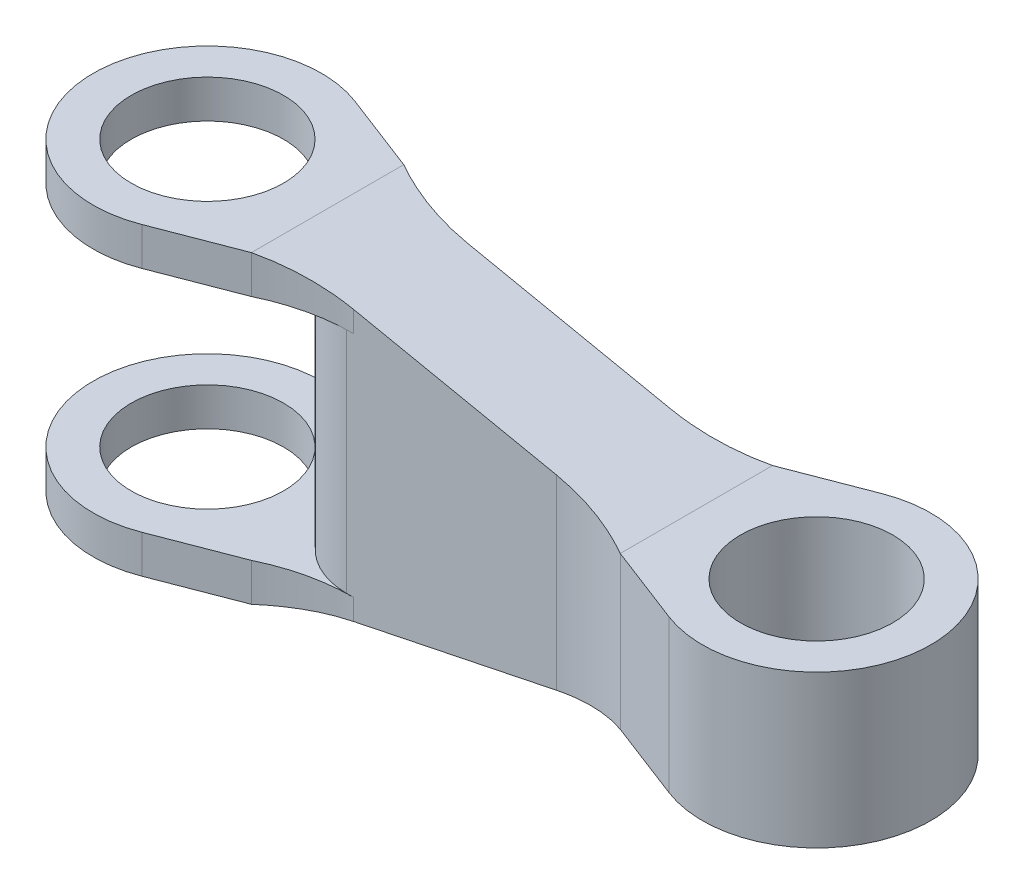
ISO-10303-21;
HEADER;
FILE_DESCRIPTION(('STEP AP214'),'2;1');
FILE_NAME('part.step','',(''),(''),'','','');
FILE_SCHEMA(('AUTOMOTIVE_DESIGN { 1 0 10303 214 1 1 1 1 }'));
ENDSEC;
DATA;
#1=APPLICATION_CONTEXT('core data for automotive mechanical design processes');
#2=APPLICATION_PROTOCOL_DEFINITION('international standard','automotive_design',2000,#1);
#3=PRODUCT_CONTEXT('',#1,'mechanical');
#4=PRODUCT('Part','Part','',(#3));
#5=PRODUCT_RELATED_PRODUCT_CATEGORY('part','',(#4));
#6=PRODUCT_DEFINITION_FORMATION('','',#4);
#7=PRODUCT_DEFINITION_CONTEXT('part definition',#1,'design');
#8=PRODUCT_DEFINITION('design','',#6,#7);
#9=PRODUCT_DEFINITION_SHAPE('','',#8);
#10=(LENGTH_UNIT() NAMED_UNIT(*) SI_UNIT(.MILLI.,.METRE.));
#11=(NAMED_UNIT(*) PLANE_ANGLE_UNIT() SI_UNIT($,.RADIAN.));
#12=(NAMED_UNIT(*) SI_UNIT($,.STERADIAN.) SOLID_ANGLE_UNIT());
#13=UNCERTAINTY_MEASURE_WITH_UNIT(LENGTH_MEASURE(1.E-05),#10,'distance_accuracy_value','');
#14=(GEOMETRIC_REPRESENTATION_CONTEXT(3) GLOBAL_UNCERTAINTY_ASSIGNED_CONTEXT((#13)) GLOBAL_UNIT_ASSIGNED_CONTEXT((#10,
#11,#12)) REPRESENTATION_CONTEXT('',''));
#15=CARTESIAN_POINT('',(0.,0.,0.));
#16=DIRECTION('',(0.,0.,1.));
#17=DIRECTION('',(1.,0.,0.));
#18=AXIS2_PLACEMENT_3D('',#15,#16,#17);
#19=CARTESIAN_POINT('',(0.,10.16,0.));
#20=DIRECTION('',(0.,-1.,0.));
#21=DIRECTION('',(0.,0.,-1.));
#22=AXIS2_PLACEMENT_3D('',#19,#20,#21);
#23=CYLINDRICAL_SURFACE('',#22,7.62);
#24=CARTESIAN_POINT('',(0.,-7.62,0.));
#25=DIRECTION('',(0.,-1.,0.));
#26=DIRECTION('',(0.,0.,-1.));
#27=AXIS2_PLACEMENT_3D('',#24,#25,#26);
#28=CIRCLE('',#27,7.62);
#29=CARTESIAN_POINT('',(2.73566372202433,-7.62,7.112));
#30=VERTEX_POINT('',#29);
#31=CARTESIAN_POINT('',(2.73566372202433,-7.62,-7.112));
#32=VERTEX_POINT('',#31);
#33=EDGE_CURVE('E326',#30,#32,#28,.T.);
#34=ORIENTED_EDGE('',*,*,#33,.T.);
#35=DIRECTION('',(0.,-1.,0.));
#36=VECTOR('',#35,1.);
#37=CARTESIAN_POINT('',(2.73566372202433,10.16,-7.112));
#38=LINE('',#37,#36);
#39=CARTESIAN_POINT('',(2.73566372202433,-10.16,-7.112));
#40=VERTEX_POINT('',#39);
#41=EDGE_CURVE('E369',#32,#40,#38,.T.);
#42=ORIENTED_EDGE('',*,*,#41,.T.);
#43=CARTESIAN_POINT('',(0.,-10.16,0.));
#44=DIRECTION('',(0.,1.,0.));
#45=DIRECTION('',(0.,0.,1.));
#46=AXIS2_PLACEMENT_3D('',#43,#44,#45);
#47=CIRCLE('',#46,7.62);
#48=CARTESIAN_POINT('',(2.73566372202433,-10.16,7.112));
#49=VERTEX_POINT('',#48);
#50=EDGE_CURVE('E357',#40,#49,#47,.T.);
#51=ORIENTED_EDGE('',*,*,#50,.T.);
#52=DIRECTION('',(0.,-1.,0.));
#53=VECTOR('',#52,1.);
#54=CARTESIAN_POINT('',(2.73566372202433,10.16,7.112));
#55=LINE('',#54,#53);
#56=EDGE_CURVE('E218',#30,#49,#55,.T.);
#57=ORIENTED_EDGE('',*,*,#56,.F.);
#58=EDGE_LOOP('',(#34,#42,#51,#57));
#59=FACE_BOUND('',#58,.T.);
#60=ADVANCED_FACE('F34',(#59),#23,.T.);
#61=CARTESIAN_POINT('',(2.73566372202433,10.16,7.112));
#62=DIRECTION('',(-0.359010987142301,0.,-0.933333333333333));
#63=DIRECTION('',(-0.933333333333333,0.,0.359010987142301));
#64=AXIS2_PLACEMENT_3D('',#61,#62,#63);
#65=PLANE('',#64);
#66=CARTESIAN_POINT('',(2.73566372202433,10.16,7.112));
#67=VERTEX_POINT('',#66);
#68=CARTESIAN_POINT('',(2.73566372202433,7.62,7.112));
#69=VERTEX_POINT('',#68);
#70=EDGE_CURVE('E219',#67,#69,#55,.T.);
#71=ORIENTED_EDGE('',*,*,#70,.T.);
#72=DIRECTION('',(0.933333333333333,0.,-0.359010987142301));
#73=VECTOR('',#72,1.);
#74=CARTESIAN_POINT('',(2.73566372202433,7.62,7.112));
#75=LINE('',#74,#73);
#76=CARTESIAN_POINT('',(8.01832470248509,7.62,5.08));
#77=VERTEX_POINT('',#76);
#78=EDGE_CURVE('E335',#69,#77,#75,.T.);
#79=ORIENTED_EDGE('',*,*,#78,.T.);
#80=DIRECTION('',(0.,-1.,0.));
#81=VECTOR('',#80,1.);
#82=CARTESIAN_POINT('',(8.01832470248509,10.16,5.08));
#83=LINE('',#82,#81);
#84=CARTESIAN_POINT('',(8.01832470248509,10.16,5.08));
#85=VERTEX_POINT('',#84);
#86=EDGE_CURVE('E215',#85,#77,#83,.T.);
#87=ORIENTED_EDGE('',*,*,#86,.F.);
#88=DIRECTION('',(0.933333333333333,0.,-0.359010987142301));
#89=VECTOR('',#88,1.);
#90=CARTESIAN_POINT('',(2.73566372202433,10.16,7.112));
#91=LINE('',#90,#89);
#92=EDGE_CURVE('E363',#67,#85,#91,.T.);
#93=ORIENTED_EDGE('',*,*,#92,.F.);
#94=EDGE_LOOP('',(#71,#79,#87,#93));
#95=FACE_BOUND('',#94,.T.);
#96=ADVANCED_FACE('F438',(#95),#65,.F.);
#97=CARTESIAN_POINT('',(2.73566372202433,10.16,-7.112));
#98=DIRECTION('',(-0.359010987142301,0.,0.933333333333333));
#99=DIRECTION('',(0.933333333333333,0.,0.359010987142301));
#100=AXIS2_PLACEMENT_3D('',#97,#98,#99);
#101=PLANE('',#100);
#102=DIRECTION('',(0.,-1.,0.));
#103=VECTOR('',#102,1.);
#104=CARTESIAN_POINT('',(8.01832470248509,10.16,-5.08));
#105=LINE('',#104,#103);
#106=CARTESIAN_POINT('',(8.01832470248509,10.16,-5.08));
#107=VERTEX_POINT('',#106);
#108=CARTESIAN_POINT('',(8.01832470248509,7.62,-5.08));
#109=VERTEX_POINT('',#108);
#110=EDGE_CURVE('E208',#107,#109,#105,.T.);
#111=ORIENTED_EDGE('',*,*,#110,.T.);
#112=DIRECTION('',(-0.933333333333333,0.,-0.359010987142301));
#113=VECTOR('',#112,1.);
#114=CARTESIAN_POINT('',(2.73566372202433,7.62,-7.112));
#115=LINE('',#114,#113);
#116=CARTESIAN_POINT('',(2.73566372202433,7.62,-7.112));
#117=VERTEX_POINT('',#116);
#118=EDGE_CURVE('E235',#109,#117,#115,.T.);
#119=ORIENTED_EDGE('',*,*,#118,.T.);
#120=CARTESIAN_POINT('',(2.73566372202433,10.16,-7.112));
#121=VERTEX_POINT('',#120);
#122=EDGE_CURVE('E377',#121,#117,#38,.T.);
#123=ORIENTED_EDGE('',*,*,#122,.F.);
#124=DIRECTION('',(-0.933333333333333,0.,-0.359010987142301));
#125=VECTOR('',#124,1.);
#126=CARTESIAN_POINT('',(2.73566372202433,10.16,-7.112));
#127=LINE('',#126,#125);
#128=EDGE_CURVE('E367',#107,#121,#127,.T.);
#129=ORIENTED_EDGE('',*,*,#128,.F.);
#130=EDGE_LOOP('',(#111,#119,#123,#129));
#131=FACE_BOUND('',#130,.T.);
#132=ADVANCED_FACE('F450',(#131),#101,.F.);
#133=CARTESIAN_POINT('',(0.,10.16,0.));
#134=DIRECTION('',(0.,-1.,0.));
#135=DIRECTION('',(0.,0.,-1.));
#136=AXIS2_PLACEMENT_3D('',#133,#134,#135);
#137=CYLINDRICAL_SURFACE('',#136,5.08);
#138=CARTESIAN_POINT('',(0.,7.62,0.));
#139=DIRECTION('',(0.,1.,0.));
#140=DIRECTION('',(0.,0.,1.));
#141=AXIS2_PLACEMENT_3D('',#138,#139,#140);
#142=CIRCLE('',#141,5.08);
#143=CARTESIAN_POINT('',(0.,7.62,5.08));
#144=VERTEX_POINT('',#143);
#145=EDGE_CURVE('E232',#144,#144,#142,.T.);
#146=ORIENTED_EDGE('',*,*,#145,.F.);
#147=EDGE_LOOP('',(#146));
#148=FACE_BOUND('',#147,.T.);
#149=CARTESIAN_POINT('',(0.,10.16,0.));
#150=DIRECTION('',(0.,1.,0.));
#151=DIRECTION('',(0.,0.,1.));
#152=AXIS2_PLACEMENT_3D('',#149,#150,#151);
#153=CIRCLE('',#152,5.08);
#154=CARTESIAN_POINT('',(0.,10.16,5.08));
#155=VERTEX_POINT('',#154);
#156=EDGE_CURVE('E354',#155,#155,#153,.T.);
#157=ORIENTED_EDGE('',*,*,#156,.T.);
#158=EDGE_LOOP('',(#157));
#159=FACE_BOUND('',#158,.T.);
#160=ADVANCED_FACE('F452',(#148,#159),#137,.F.);
#161=CARTESIAN_POINT('',(0.,10.16,0.));
#162=DIRECTION('',(0.,1.,0.));
#163=DIRECTION('',(0.,0.,1.));
#164=AXIS2_PLACEMENT_3D('',#161,#162,#163);
#165=PLANE('',#164);
#166=DIRECTION('',(0.,0.,1.));
#167=VECTOR('',#166,1.);
#168=CARTESIAN_POINT('',(8.01832470248509,10.16,-7.62));
#169=LINE('',#168,#167);
#170=EDGE_CURVE('E338',#107,#85,#169,.T.);
#171=ORIENTED_EDGE('',*,*,#170,.F.);
#172=ORIENTED_EDGE('',*,*,#128,.T.);
#173=CARTESIAN_POINT('',(0.,10.16,0.));
#174=DIRECTION('',(0.,1.,0.));
#175=DIRECTION('',(0.,0.,1.));
#176=AXIS2_PLACEMENT_3D('',#173,#174,#175);
#177=CIRCLE('',#176,7.62);
#178=EDGE_CURVE('E360',#121,#67,#177,.T.);
#179=ORIENTED_EDGE('',*,*,#178,.T.);
#180=ORIENTED_EDGE('',*,*,#92,.T.);
#181=EDGE_LOOP('',(#171,#172,#179,#180));
#182=FACE_BOUND('',#181,.T.);
#183=ORIENTED_EDGE('',*,*,#156,.F.);
#184=EDGE_LOOP('',(#183));
#185=FACE_BOUND('',#184,.T.);
#186=ADVANCED_FACE('F443',(#182,#185),#165,.T.);
#187=CARTESIAN_POINT('',(0.,-10.16,0.));
#188=DIRECTION('',(0.,1.,0.));
#189=DIRECTION('',(0.,0.,1.));
#190=AXIS2_PLACEMENT_3D('',#187,#188,#189);
#191=PLANE('',#190);
#192=CARTESIAN_POINT('',(0.,-10.16,0.));
#193=DIRECTION('',(0.,1.,0.));
#194=DIRECTION('',(0.,0.,1.));
#195=AXIS2_PLACEMENT_3D('',#192,#193,#194);
#196=CIRCLE('',#195,5.08);
#197=CARTESIAN_POINT('',(0.,-10.16,5.08));
#198=VERTEX_POINT('',#197);
#199=EDGE_CURVE('E353',#198,#198,#196,.T.);
#200=ORIENTED_EDGE('',*,*,#199,.T.);
#201=EDGE_LOOP('',(#200));
#202=FACE_BOUND('',#201,.T.);
#203=DIRECTION('',(-0.933333333333333,0.,-0.359010987142301));
#204=VECTOR('',#203,1.);
#205=CARTESIAN_POINT('',(2.73566372202433,-10.16,-7.112));
#206=LINE('',#205,#204);
#207=CARTESIAN_POINT('',(8.01832470248509,-10.16,-5.08));
#208=VERTEX_POINT('',#207);
#209=EDGE_CURVE('E364',#208,#40,#206,.T.);
#210=ORIENTED_EDGE('',*,*,#209,.F.);
#211=DIRECTION('',(0.,0.,1.));
#212=VECTOR('',#211,1.);
#213=CARTESIAN_POINT('',(8.01832470248509,-10.16,-7.62));
#214=LINE('',#213,#212);
#215=CARTESIAN_POINT('',(8.01832470248509,-10.16,5.08));
#216=VERTEX_POINT('',#215);
#217=EDGE_CURVE('E239',#208,#216,#214,.T.);
#218=ORIENTED_EDGE('',*,*,#217,.T.);
#219=DIRECTION('',(0.933333333333333,0.,-0.359010987142301));
#220=VECTOR('',#219,1.);
#221=CARTESIAN_POINT('',(2.73566372202433,-10.16,7.112));
#222=LINE('',#221,#220);
#223=EDGE_CURVE('E372',#49,#216,#222,.T.);
#224=ORIENTED_EDGE('',*,*,#223,.F.);
#225=ORIENTED_EDGE('',*,*,#50,.F.);
#226=EDGE_LOOP('',(#210,#218,#224,#225));
#227=FACE_BOUND('',#226,.T.);
#228=ADVANCED_FACE('F395',(#202,#227),#191,.F.);
#229=ORIENTED_EDGE('',*,*,#122,.T.);
#230=CARTESIAN_POINT('',(0.,7.62,0.));
#231=DIRECTION('',(0.,1.,0.));
#232=DIRECTION('',(0.,0.,1.));
#233=AXIS2_PLACEMENT_3D('',#230,#231,#232);
#234=CIRCLE('',#233,7.62);
#235=EDGE_CURVE('E332',#117,#69,#234,.T.);
#236=ORIENTED_EDGE('',*,*,#235,.T.);
#237=ORIENTED_EDGE('',*,*,#70,.F.);
#238=ORIENTED_EDGE('',*,*,#178,.F.);
#239=EDGE_LOOP('',(#229,#236,#237,#238));
#240=FACE_BOUND('',#239,.T.);
#241=ADVANCED_FACE('F448',(#240),#23,.T.);
#242=CARTESIAN_POINT('',(8.01832470248509,-7.62,5.08));
#243=VERTEX_POINT('',#242);
#244=EDGE_CURVE('E214',#243,#216,#83,.T.);
#245=ORIENTED_EDGE('',*,*,#244,.F.);
#246=DIRECTION('',(-0.933333333333333,0.,0.359010987142301));
#247=VECTOR('',#246,1.);
#248=CARTESIAN_POINT('',(2.73566372202433,-7.62,7.112));
#249=LINE('',#248,#247);
#250=EDGE_CURVE('E236',#243,#30,#249,.T.);
#251=ORIENTED_EDGE('',*,*,#250,.T.);
#252=ORIENTED_EDGE('',*,*,#56,.T.);
#253=ORIENTED_EDGE('',*,*,#223,.T.);
#254=EDGE_LOOP('',(#245,#251,#252,#253));
#255=FACE_BOUND('',#254,.T.);
#256=ADVANCED_FACE('F430',(#255),#65,.F.);
#257=CARTESIAN_POINT('',(8.01832470248509,10.16,3.81));
#258=DIRECTION('',(0.,0.,-1.));
#259=DIRECTION('',(-1.,0.,0.));
#260=AXIS2_PLACEMENT_3D('',#257,#258,#259);
#261=PLANE('',#260);
#262=DIRECTION('',(-1.,0.,0.));
#263=VECTOR('',#262,1.);
#264=CARTESIAN_POINT('',(-7.62,7.62,3.81));
#265=LINE('',#264,#263);
#266=CARTESIAN_POINT('',(13.5541263607817,7.62,3.81));
#267=VERTEX_POINT('',#266);
#268=CARTESIAN_POINT('',(13.0983247024851,7.62,3.81));
#269=VERTEX_POINT('',#268);
#270=EDGE_CURVE('E222',#267,#269,#265,.T.);
#271=ORIENTED_EDGE('',*,*,#270,.T.);
#272=DIRECTION('',(0.,-1.,0.));
#273=VECTOR('',#272,1.);
#274=CARTESIAN_POINT('',(13.0983247024851,10.16,3.81));
#275=LINE('',#274,#273);
#276=CARTESIAN_POINT('',(13.0983247024851,-7.62,3.81));
#277=VERTEX_POINT('',#276);
#278=EDGE_CURVE('E297',#269,#277,#275,.T.);
#279=ORIENTED_EDGE('',*,*,#278,.T.);
#280=DIRECTION('',(1.,0.,0.));
#281=VECTOR('',#280,1.);
#282=CARTESIAN_POINT('',(-7.62,-7.62,3.81));
#283=LINE('',#282,#281);
#284=CARTESIAN_POINT('',(13.5541263607817,-7.62,3.81));
#285=VERTEX_POINT('',#284);
#286=EDGE_CURVE('E245',#277,#285,#283,.T.);
#287=ORIENTED_EDGE('',*,*,#286,.T.);
#288=DIRECTION('',(0.,-1.,0.));
#289=VECTOR('',#288,1.);
#290=CARTESIAN_POINT('',(13.5541263607817,10.16,3.81));
#291=LINE('',#290,#289);
#292=CARTESIAN_POINT('',(13.5541263607817,-9.01699013573265,3.81));
#293=VERTEX_POINT('',#292);
#294=EDGE_CURVE('E247',#285,#293,#291,.T.);
#295=ORIENTED_EDGE('',*,*,#294,.T.);
#296=DIRECTION('',(0.979342066351469,0.202210576069687,0.));
#297=VECTOR('',#296,1.);
#298=CARTESIAN_POINT('',(12.0423618340992,-9.32913314104749,3.81));
#299=LINE('',#298,#297);
#300=CARTESIAN_POINT('',(27.0858736392183,-6.22300986426735,3.81));
#301=VERTEX_POINT('',#300);
#302=EDGE_CURVE('E231',#293,#301,#299,.T.);
#303=ORIENTED_EDGE('',*,*,#302,.T.);
#304=DIRECTION('',(0.,1.,0.));
#305=VECTOR('',#304,1.);
#306=CARTESIAN_POINT('',(27.0858736392183,10.16,3.81));
#307=LINE('',#306,#305);
#308=CARTESIAN_POINT('',(27.0858736392183,6.22300986426735,3.81));
#309=VERTEX_POINT('',#308);
#310=EDGE_CURVE('E250',#301,#309,#307,.T.);
#311=ORIENTED_EDGE('',*,*,#310,.T.);
#312=DIRECTION('',(-0.979342066351469,0.202210576069687,0.));
#313=VECTOR('',#312,1.);
#314=CARTESIAN_POINT('',(8.01832470248509,10.16,3.81));
#315=LINE('',#314,#313);
#316=CARTESIAN_POINT('',(13.5541263607817,9.01699013573265,3.81));
#317=VERTEX_POINT('',#316);
#318=EDGE_CURVE('E350',#309,#317,#315,.T.);
#319=ORIENTED_EDGE('',*,*,#318,.T.);
#320=DIRECTION('',(0.,-1.,0.));
#321=VECTOR('',#320,1.);
#322=CARTESIAN_POINT('',(13.5541263607817,10.16,3.81));
#323=LINE('',#322,#321);
#324=EDGE_CURVE('E242',#317,#267,#323,.T.);
#325=ORIENTED_EDGE('',*,*,#324,.T.);
#326=EDGE_LOOP('',(#271,#279,#287,#295,#303,#311,#319,#325));
#327=FACE_BOUND('',#326,.T.);
#328=ADVANCED_FACE('F422',(#327),#261,.F.);
#329=CARTESIAN_POINT('',(32.6216752975149,10.16,5.08));
#330=DIRECTION('',(0.359010987142301,0.,-0.933333333333333));
#331=DIRECTION('',(-0.933333333333333,0.,-0.359010987142301));
#332=AXIS2_PLACEMENT_3D('',#329,#330,#331);
#333=PLANE('',#332);
#334=DIRECTION('',(0.,-1.,0.));
#335=VECTOR('',#334,1.);
#336=CARTESIAN_POINT('',(32.6216752975149,10.16,5.08));
#337=LINE('',#336,#335);
#338=CARTESIAN_POINT('',(32.6216752975149,5.08,5.08));
#339=VERTEX_POINT('',#338);
#340=CARTESIAN_POINT('',(32.6216752975149,-5.08,5.08));
#341=VERTEX_POINT('',#340);
#342=EDGE_CURVE('E205',#339,#341,#337,.T.);
#343=ORIENTED_EDGE('',*,*,#342,.T.);
#344=DIRECTION('',(0.933333333333333,0.,0.359010987142301));
#345=VECTOR('',#344,1.);
#346=CARTESIAN_POINT('',(32.6216752975149,-5.08,5.08));
#347=LINE('',#346,#345);
#348=CARTESIAN_POINT('',(37.9043362779757,-5.08,7.112));
#349=VERTEX_POINT('',#348);
#350=EDGE_CURVE('E188',#341,#349,#347,.T.);
#351=ORIENTED_EDGE('',*,*,#350,.T.);
#352=DIRECTION('',(0.,-1.,0.));
#353=VECTOR('',#352,1.);
#354=CARTESIAN_POINT('',(37.9043362779757,10.16,7.112));
#355=LINE('',#354,#353);
#356=CARTESIAN_POINT('',(37.9043362779757,5.08,7.112));
#357=VERTEX_POINT('',#356);
#358=EDGE_CURVE('E184',#357,#349,#355,.T.);
#359=ORIENTED_EDGE('',*,*,#358,.F.);
#360=DIRECTION('',(-0.933333333333333,0.,-0.359010987142301));
#361=VECTOR('',#360,1.);
#362=CARTESIAN_POINT('',(32.6216752975149,5.08,5.08));
#363=LINE('',#362,#361);
#364=EDGE_CURVE('E344',#357,#339,#363,.T.);
#365=ORIENTED_EDGE('',*,*,#364,.T.);
#366=EDGE_LOOP('',(#343,#351,#359,#365));
#367=FACE_BOUND('',#366,.T.);
#368=ADVANCED_FACE('F416',(#367),#333,.F.);
#369=CARTESIAN_POINT('',(40.64,10.16,0.));
#370=DIRECTION('',(0.,-1.,0.));
#371=DIRECTION('',(0.,0.,-1.));
#372=AXIS2_PLACEMENT_3D('',#369,#370,#371);
#373=CYLINDRICAL_SURFACE('',#372,7.62);
#374=CARTESIAN_POINT('',(40.64,-5.08,0.));
#375=DIRECTION('',(0.,1.,0.));
#376=DIRECTION('',(0.,0.,1.));
#377=AXIS2_PLACEMENT_3D('',#374,#375,#376);
#378=CIRCLE('',#377,7.62);
#379=CARTESIAN_POINT('',(37.9043362779757,-5.08,-7.112));
#380=VERTEX_POINT('',#379);
#381=EDGE_CURVE('E177',#349,#380,#378,.T.);
#382=ORIENTED_EDGE('',*,*,#381,.T.);
#383=DIRECTION('',(0.,-1.,0.));
#384=VECTOR('',#383,1.);
#385=CARTESIAN_POINT('',(37.9043362779757,10.16,-7.112));
#386=LINE('',#385,#384);
#387=CARTESIAN_POINT('',(37.9043362779757,5.08,-7.112));
#388=VERTEX_POINT('',#387);
#389=EDGE_CURVE('E182',#388,#380,#386,.T.);
#390=ORIENTED_EDGE('',*,*,#389,.F.);
#391=CARTESIAN_POINT('',(40.64,5.08,0.));
#392=DIRECTION('',(0.,-1.,0.));
#393=DIRECTION('',(0.,0.,-1.));
#394=AXIS2_PLACEMENT_3D('',#391,#392,#393);
#395=CIRCLE('',#394,7.62);
#396=EDGE_CURVE('E342',#388,#357,#395,.T.);
#397=ORIENTED_EDGE('',*,*,#396,.T.);
#398=ORIENTED_EDGE('',*,*,#358,.T.);
#399=EDGE_LOOP('',(#382,#390,#397,#398));
#400=FACE_BOUND('',#399,.T.);
#401=ADVANCED_FACE('F179',(#400),#373,.T.);
#402=CARTESIAN_POINT('',(32.6216752975149,10.16,-5.08));
#403=DIRECTION('',(0.359010987142301,0.,0.933333333333333));
#404=DIRECTION('',(0.933333333333333,0.,-0.359010987142301));
#405=AXIS2_PLACEMENT_3D('',#402,#403,#404);
#406=PLANE('',#405);
#407=ORIENTED_EDGE('',*,*,#389,.T.);
#408=DIRECTION('',(-0.933333333333333,0.,0.359010987142301));
#409=VECTOR('',#408,1.);
#410=CARTESIAN_POINT('',(32.6216752975149,-5.08,-5.08));
#411=LINE('',#410,#409);
#412=CARTESIAN_POINT('',(32.6216752975149,-5.08,-5.08));
#413=VERTEX_POINT('',#412);
#414=EDGE_CURVE('E189',#380,#413,#411,.T.);
#415=ORIENTED_EDGE('',*,*,#414,.T.);
#416=DIRECTION('',(0.,-1.,0.));
#417=VECTOR('',#416,1.);
#418=CARTESIAN_POINT('',(32.6216752975149,10.16,-5.08));
#419=LINE('',#418,#417);
#420=CARTESIAN_POINT('',(32.6216752975149,5.08,-5.08));
#421=VERTEX_POINT('',#420);
#422=EDGE_CURVE('E203',#421,#413,#419,.T.);
#423=ORIENTED_EDGE('',*,*,#422,.F.);
#424=DIRECTION('',(0.933333333333333,0.,-0.359010987142301));
#425=VECTOR('',#424,1.);
#426=CARTESIAN_POINT('',(32.6216752975149,5.08,-5.08));
#427=LINE('',#426,#425);
#428=EDGE_CURVE('E202',#421,#388,#427,.T.);
#429=ORIENTED_EDGE('',*,*,#428,.T.);
#430=EDGE_LOOP('',(#407,#415,#423,#429));
#431=FACE_BOUND('',#430,.T.);
#432=ADVANCED_FACE('F200',(#431),#406,.F.);
#433=CARTESIAN_POINT('',(8.01832470248509,10.16,-3.81));
#434=DIRECTION('',(0.,0.,1.));
#435=DIRECTION('',(1.,0.,0.));
#436=AXIS2_PLACEMENT_3D('',#433,#434,#435);
#437=PLANE('',#436);
#438=DIRECTION('',(-1.,0.,0.));
#439=VECTOR('',#438,1.);
#440=CARTESIAN_POINT('',(-7.62,-7.62,-3.81));
#441=LINE('',#440,#439);
#442=CARTESIAN_POINT('',(13.5541263607817,-7.62,-3.81));
#443=VERTEX_POINT('',#442);
#444=CARTESIAN_POINT('',(13.0983247024851,-7.62,-3.81));
#445=VERTEX_POINT('',#444);
#446=EDGE_CURVE('E256',#443,#445,#441,.T.);
#447=ORIENTED_EDGE('',*,*,#446,.T.);
#448=DIRECTION('',(0.,1.,0.));
#449=VECTOR('',#448,1.);
#450=CARTESIAN_POINT('',(13.0983247024851,10.16,-3.81));
#451=LINE('',#450,#449);
#452=CARTESIAN_POINT('',(13.0983247024851,7.62,-3.81));
#453=VERTEX_POINT('',#452);
#454=EDGE_CURVE('E294',#445,#453,#451,.T.);
#455=ORIENTED_EDGE('',*,*,#454,.T.);
#456=DIRECTION('',(1.,0.,0.));
#457=VECTOR('',#456,1.);
#458=CARTESIAN_POINT('',(-7.62,7.62,-3.81));
#459=LINE('',#458,#457);
#460=CARTESIAN_POINT('',(13.5541263607817,7.62,-3.81));
#461=VERTEX_POINT('',#460);
#462=EDGE_CURVE('E254',#453,#461,#459,.T.);
#463=ORIENTED_EDGE('',*,*,#462,.T.);
#464=DIRECTION('',(0.,1.,0.));
#465=VECTOR('',#464,1.);
#466=CARTESIAN_POINT('',(13.5541263607817,10.16,-3.81));
#467=LINE('',#466,#465);
#468=CARTESIAN_POINT('',(13.5541263607817,9.01699013573265,-3.81));
#469=VERTEX_POINT('',#468);
#470=EDGE_CURVE('E252',#461,#469,#467,.T.);
#471=ORIENTED_EDGE('',*,*,#470,.T.);
#472=DIRECTION('',(0.979342066351469,-0.202210576069687,0.));
#473=VECTOR('',#472,1.);
#474=CARTESIAN_POINT('',(8.01832470248509,10.16,-3.81));
#475=LINE('',#474,#473);
#476=CARTESIAN_POINT('',(27.0858736392183,6.22300986426735,-3.81));
#477=VERTEX_POINT('',#476);
#478=EDGE_CURVE('E347',#469,#477,#475,.T.);
#479=ORIENTED_EDGE('',*,*,#478,.T.);
#480=DIRECTION('',(0.,-1.,0.));
#481=VECTOR('',#480,1.);
#482=CARTESIAN_POINT('',(27.0858736392183,10.16,-3.81));
#483=LINE('',#482,#481);
#484=CARTESIAN_POINT('',(27.0858736392183,-6.22300986426735,-3.81));
#485=VERTEX_POINT('',#484);
#486=EDGE_CURVE('E262',#477,#485,#483,.T.);
#487=ORIENTED_EDGE('',*,*,#486,.T.);
#488=DIRECTION('',(-0.979342066351469,-0.202210576069687,0.));
#489=VECTOR('',#488,1.);
#490=CARTESIAN_POINT('',(12.0423618340992,-9.32913314104749,-3.81));
#491=LINE('',#490,#489);
#492=CARTESIAN_POINT('',(13.5541263607817,-9.01699013573265,-3.81));
#493=VERTEX_POINT('',#492);
#494=EDGE_CURVE('E320',#485,#493,#491,.T.);
#495=ORIENTED_EDGE('',*,*,#494,.T.);
#496=DIRECTION('',(0.,1.,0.));
#497=VECTOR('',#496,1.);
#498=CARTESIAN_POINT('',(13.5541263607817,10.16,-3.81));
#499=LINE('',#498,#497);
#500=EDGE_CURVE('E259',#493,#443,#499,.T.);
#501=ORIENTED_EDGE('',*,*,#500,.T.);
#502=EDGE_LOOP('',(#447,#455,#463,#471,#479,#487,#495,#501));
#503=FACE_BOUND('',#502,.T.);
#504=ADVANCED_FACE('F308',(#503),#437,.F.);
#505=ORIENTED_EDGE('',*,*,#41,.F.);
#506=DIRECTION('',(0.933333333333333,0.,0.359010987142301));
#507=VECTOR('',#506,1.);
#508=CARTESIAN_POINT('',(2.73566372202433,-7.62,-7.112));
#509=LINE('',#508,#507);
#510=CARTESIAN_POINT('',(8.01832470248509,-7.62,-5.08));
#511=VERTEX_POINT('',#510);
#512=EDGE_CURVE('E230',#32,#511,#509,.T.);
#513=ORIENTED_EDGE('',*,*,#512,.T.);
#514=EDGE_CURVE('E379',#511,#208,#105,.T.);
#515=ORIENTED_EDGE('',*,*,#514,.T.);
#516=ORIENTED_EDGE('',*,*,#209,.T.);
#517=EDGE_LOOP('',(#505,#513,#515,#516));
#518=FACE_BOUND('',#517,.T.);
#519=ADVANCED_FACE('F389',(#518),#101,.F.);
#520=CARTESIAN_POINT('',(0.,-7.62,0.));
#521=DIRECTION('',(0.,-1.,0.));
#522=DIRECTION('',(0.,0.,-1.));
#523=AXIS2_PLACEMENT_3D('',#520,#521,#522);
#524=CIRCLE('',#523,5.08);
#525=CARTESIAN_POINT('',(0.,-7.62,-5.08));
#526=VERTEX_POINT('',#525);
#527=EDGE_CURVE('E227',#526,#526,#524,.T.);
#528=ORIENTED_EDGE('',*,*,#527,.F.);
#529=EDGE_LOOP('',(#528));
#530=FACE_BOUND('',#529,.T.);
#531=ORIENTED_EDGE('',*,*,#199,.F.);
#532=EDGE_LOOP('',(#531));
#533=FACE_BOUND('',#532,.T.);
#534=ADVANCED_FACE('F460',(#530,#533),#137,.F.);
#535=CARTESIAN_POINT('',(40.64,10.16,0.));
#536=DIRECTION('',(0.,-1.,0.));
#537=DIRECTION('',(0.,0.,-1.));
#538=AXIS2_PLACEMENT_3D('',#535,#536,#537);
#539=CYLINDRICAL_SURFACE('',#538,5.08);
#540=CARTESIAN_POINT('',(40.64,-5.08,0.));
#541=DIRECTION('',(0.,1.,0.));
#542=DIRECTION('',(0.,0.,1.));
#543=AXIS2_PLACEMENT_3D('',#540,#541,#542);
#544=CIRCLE('',#543,5.08);
#545=CARTESIAN_POINT('',(40.64,-5.08,5.08));
#546=VERTEX_POINT('',#545);
#547=EDGE_CURVE('E197',#546,#546,#544,.T.);
#548=ORIENTED_EDGE('',*,*,#547,.F.);
#549=EDGE_LOOP('',(#548));
#550=FACE_BOUND('',#549,.T.);
#551=CARTESIAN_POINT('',(40.64,5.08,0.));
#552=DIRECTION('',(0.,-1.,0.));
#553=DIRECTION('',(0.,0.,-1.));
#554=AXIS2_PLACEMENT_3D('',#551,#552,#553);
#555=CIRCLE('',#554,5.08);
#556=CARTESIAN_POINT('',(40.64,5.08,-5.08));
#557=VERTEX_POINT('',#556);
#558=EDGE_CURVE('E223',#557,#557,#555,.T.);
#559=ORIENTED_EDGE('',*,*,#558,.F.);
#560=EDGE_LOOP('',(#559));
#561=FACE_BOUND('',#560,.T.);
#562=ADVANCED_FACE('F482',(#550,#561),#539,.F.);
#563=CARTESIAN_POINT('',(8.01832470248509,10.16,-7.62));
#564=DIRECTION('',(-0.202210576069687,-0.979342066351469,0.));
#565=DIRECTION('',(0.979342066351469,-0.202210576069687,0.));
#566=AXIS2_PLACEMENT_3D('',#563,#564,#565);
#567=PLANE('',#566);
#568=DIRECTION('',(0.,0.,1.));
#569=VECTOR('',#568,1.);
#570=CARTESIAN_POINT('',(32.6216752975149,5.08,-7.62));
#571=LINE('',#570,#569);
#572=EDGE_CURVE('E226',#421,#339,#571,.T.);
#573=ORIENTED_EDGE('',*,*,#572,.F.);
#574=CARTESIAN_POINT('',(27.0858736392183,6.22300986426735,-16.51));
#575=DIRECTION('',(-0.202210576069687,-0.979342066351469,0.));
#576=DIRECTION('',(0.979342066351469,-0.202210576069687,0.));
#577=AXIS2_PLACEMENT_3D('',#574,#575,#576);
#578=ELLIPSE('',#577,12.9678898071986,12.7);
#579=EDGE_CURVE('E272',#421,#477,#578,.T.);
#580=ORIENTED_EDGE('',*,*,#579,.T.);
#581=ORIENTED_EDGE('',*,*,#478,.F.);
#582=CARTESIAN_POINT('',(13.5541263607817,9.01699013573265,-16.51));
#583=DIRECTION('',(-0.202210576069687,-0.979342066351469,0.));
#584=DIRECTION('',(-0.979342066351469,0.202210576069687,0.));
#585=AXIS2_PLACEMENT_3D('',#582,#583,#584);
#586=ELLIPSE('',#585,12.9678898071986,12.7);
#587=EDGE_CURVE('E281',#469,#107,#586,.T.);
#588=ORIENTED_EDGE('',*,*,#587,.T.);
#589=ORIENTED_EDGE('',*,*,#170,.T.);
#590=CARTESIAN_POINT('',(13.5541263607817,9.01699013573265,16.51));
#591=DIRECTION('',(-0.202210576069687,-0.979342066351469,0.));
#592=DIRECTION('',(0.979342066351469,-0.202210576069687,0.));
#593=AXIS2_PLACEMENT_3D('',#590,#591,#592);
#594=ELLIPSE('',#593,12.9678898071986,12.7);
#595=EDGE_CURVE('E292',#85,#317,#594,.T.);
#596=ORIENTED_EDGE('',*,*,#595,.T.);
#597=ORIENTED_EDGE('',*,*,#318,.F.);
#598=CARTESIAN_POINT('',(27.0858736392183,6.22300986426735,16.51));
#599=DIRECTION('',(-0.202210576069687,-0.979342066351469,0.));
#600=DIRECTION('',(-0.979342066351469,0.202210576069687,0.));
#601=AXIS2_PLACEMENT_3D('',#598,#599,#600);
#602=ELLIPSE('',#601,12.9678898071986,12.7);
#603=EDGE_CURVE('E267',#309,#339,#602,.T.);
#604=ORIENTED_EDGE('',*,*,#603,.T.);
#605=EDGE_LOOP('',(#573,#580,#581,#588,#589,#596,#597,#604));
#606=FACE_BOUND('',#605,.T.);
#607=ADVANCED_FACE('F408',(#606),#567,.F.);
#608=CARTESIAN_POINT('',(32.6216752975149,5.08,-7.62));
#609=DIRECTION('',(0.,-1.,0.));
#610=DIRECTION('',(0.,0.,-1.));
#611=AXIS2_PLACEMENT_3D('',#608,#609,#610);
#612=PLANE('',#611);
#613=ORIENTED_EDGE('',*,*,#558,.T.);
#614=EDGE_LOOP('',(#613));
#615=FACE_BOUND('',#614,.T.);
#616=ORIENTED_EDGE('',*,*,#396,.F.);
#617=ORIENTED_EDGE('',*,*,#428,.F.);
#618=ORIENTED_EDGE('',*,*,#572,.T.);
#619=ORIENTED_EDGE('',*,*,#364,.F.);
#620=EDGE_LOOP('',(#616,#617,#618,#619));
#621=FACE_BOUND('',#620,.T.);
#622=ADVANCED_FACE('F414',(#615,#621),#612,.F.);
#623=CARTESIAN_POINT('',(-7.62,7.62,-7.62));
#624=DIRECTION('',(0.,1.,0.));
#625=DIRECTION('',(0.,0.,1.));
#626=AXIS2_PLACEMENT_3D('',#623,#624,#625);
#627=PLANE('',#626);
#628=ORIENTED_EDGE('',*,*,#145,.T.);
#629=EDGE_LOOP('',(#628));
#630=FACE_BOUND('',#629,.T.);
#631=ORIENTED_EDGE('',*,*,#235,.F.);
#632=ORIENTED_EDGE('',*,*,#118,.F.);
#633=CARTESIAN_POINT('',(13.5541263607817,7.62,-16.51));
#634=DIRECTION('',(0.,1.,0.));
#635=DIRECTION('',(0.,0.,1.));
#636=AXIS2_PLACEMENT_3D('',#633,#634,#635);
#637=CIRCLE('',#636,12.7);
#638=EDGE_CURVE('E278',#109,#461,#637,.T.);
#639=ORIENTED_EDGE('',*,*,#638,.T.);
#640=ORIENTED_EDGE('',*,*,#462,.F.);
#641=CARTESIAN_POINT('',(13.0983247024851,7.62,1.27));
#642=DIRECTION('',(0.,1.,0.));
#643=DIRECTION('',(0.,0.,1.));
#644=AXIS2_PLACEMENT_3D('',#641,#642,#643);
#645=CIRCLE('',#644,5.08);
#646=CARTESIAN_POINT('',(8.17963585280167,7.62,0.));
#647=VERTEX_POINT('',#646);
#648=EDGE_CURVE('E56',#453,#647,#645,.T.);
#649=ORIENTED_EDGE('',*,*,#648,.T.);
#650=CARTESIAN_POINT('',(13.0983247024851,7.62,-1.27));
#651=DIRECTION('',(0.,1.,0.));
#652=DIRECTION('',(0.,0.,1.));
#653=AXIS2_PLACEMENT_3D('',#650,#651,#652);
#654=CIRCLE('',#653,5.08);
#655=EDGE_CURVE('E11',#647,#269,#654,.T.);
#656=ORIENTED_EDGE('',*,*,#655,.T.);
#657=ORIENTED_EDGE('',*,*,#270,.F.);
#658=CARTESIAN_POINT('',(13.5541263607817,7.62,16.51));
#659=DIRECTION('',(0.,1.,0.));
#660=DIRECTION('',(0.,0.,1.));
#661=AXIS2_PLACEMENT_3D('',#658,#659,#660);
#662=CIRCLE('',#661,12.7);
#663=EDGE_CURVE('E290',#267,#77,#662,.T.);
#664=ORIENTED_EDGE('',*,*,#663,.T.);
#665=ORIENTED_EDGE('',*,*,#78,.F.);
#666=EDGE_LOOP('',(#631,#632,#639,#640,#649,#656,#657,#664,#665));
#667=FACE_BOUND('',#666,.T.);
#668=ADVANCED_FACE('F434',(#630,#667),#627,.F.);
#669=CARTESIAN_POINT('',(-7.62,-7.62,-7.62));
#670=DIRECTION('',(0.,-1.,0.));
#671=DIRECTION('',(0.,0.,-1.));
#672=AXIS2_PLACEMENT_3D('',#669,#670,#671);
#673=PLANE('',#672);
#674=ORIENTED_EDGE('',*,*,#527,.T.);
#675=EDGE_LOOP('',(#674));
#676=FACE_BOUND('',#675,.T.);
#677=ORIENTED_EDGE('',*,*,#250,.F.);
#678=CARTESIAN_POINT('',(13.5541263607817,-7.62,16.51));
#679=DIRECTION('',(0.,-1.,0.));
#680=DIRECTION('',(0.,0.,-1.));
#681=AXIS2_PLACEMENT_3D('',#678,#679,#680);
#682=CIRCLE('',#681,12.7);
#683=EDGE_CURVE('E287',#243,#285,#682,.T.);
#684=ORIENTED_EDGE('',*,*,#683,.T.);
#685=ORIENTED_EDGE('',*,*,#286,.F.);
#686=CARTESIAN_POINT('',(13.0983247024851,-7.62,-1.27));
#687=DIRECTION('',(0.,-1.,0.));
#688=DIRECTION('',(0.,0.,-1.));
#689=AXIS2_PLACEMENT_3D('',#686,#687,#688);
#690=CIRCLE('',#689,5.08);
#691=CARTESIAN_POINT('',(8.17963585280167,-7.62,0.));
#692=VERTEX_POINT('',#691);
#693=EDGE_CURVE('E43',#277,#692,#690,.T.);
#694=ORIENTED_EDGE('',*,*,#693,.T.);
#695=CARTESIAN_POINT('',(13.0983247024851,-7.62,1.27));
#696=DIRECTION('',(0.,-1.,0.));
#697=DIRECTION('',(0.,0.,-1.));
#698=AXIS2_PLACEMENT_3D('',#695,#696,#697);
#699=CIRCLE('',#698,5.08);
#700=EDGE_CURVE('E300',#692,#445,#699,.T.);
#701=ORIENTED_EDGE('',*,*,#700,.T.);
#702=ORIENTED_EDGE('',*,*,#446,.F.);
#703=CARTESIAN_POINT('',(13.5541263607817,-7.62,-16.51));
#704=DIRECTION('',(0.,-1.,0.));
#705=DIRECTION('',(0.,0.,-1.));
#706=AXIS2_PLACEMENT_3D('',#703,#704,#705);
#707=CIRCLE('',#706,12.7);
#708=EDGE_CURVE('E276',#443,#511,#707,.T.);
#709=ORIENTED_EDGE('',*,*,#708,.T.);
#710=ORIENTED_EDGE('',*,*,#512,.F.);
#711=ORIENTED_EDGE('',*,*,#33,.F.);
#712=EDGE_LOOP('',(#677,#684,#685,#694,#701,#702,#709,#710,#711));
#713=FACE_BOUND('',#712,.T.);
#714=ADVANCED_FACE('F303',(#676,#713),#673,.F.);
#715=CARTESIAN_POINT('',(8.01832470248509,-10.16,-7.62));
#716=DIRECTION('',(-0.202210576069687,0.979342066351469,0.));
#717=DIRECTION('',(-0.979342066351469,-0.202210576069687,0.));
#718=AXIS2_PLACEMENT_3D('',#715,#716,#717);
#719=PLANE('',#718);
#720=ORIENTED_EDGE('',*,*,#217,.F.);
#721=CARTESIAN_POINT('',(13.5541263607817,-9.01699013573265,-16.51));
#722=DIRECTION('',(-0.202210576069687,0.979342066351469,0.));
#723=DIRECTION('',(0.979342066351469,0.202210576069687,0.));
#724=AXIS2_PLACEMENT_3D('',#721,#722,#723);
#725=ELLIPSE('',#724,12.9678898071986,12.7);
#726=EDGE_CURVE('E274',#208,#493,#725,.T.);
#727=ORIENTED_EDGE('',*,*,#726,.T.);
#728=ORIENTED_EDGE('',*,*,#494,.F.);
#729=CARTESIAN_POINT('',(27.0858736392183,-6.22300986426735,-16.51));
#730=DIRECTION('',(-0.202210576069687,0.979342066351469,0.));
#731=DIRECTION('',(-0.979342066351469,-0.202210576069687,0.));
#732=AXIS2_PLACEMENT_3D('',#729,#730,#731);
#733=ELLIPSE('',#732,12.9678898071986,12.7);
#734=EDGE_CURVE('E270',#485,#413,#733,.T.);
#735=ORIENTED_EDGE('',*,*,#734,.T.);
#736=DIRECTION('',(0.,0.,1.));
#737=VECTOR('',#736,1.);
#738=CARTESIAN_POINT('',(32.6216752975149,-5.08,-7.62));
#739=LINE('',#738,#737);
#740=EDGE_CURVE('E193',#413,#341,#739,.T.);
#741=ORIENTED_EDGE('',*,*,#740,.T.);
#742=CARTESIAN_POINT('',(27.0858736392183,-6.22300986426735,16.51));
#743=DIRECTION('',(-0.202210576069687,0.979342066351469,0.));
#744=DIRECTION('',(0.979342066351469,0.202210576069687,0.));
#745=AXIS2_PLACEMENT_3D('',#742,#743,#744);
#746=ELLIPSE('',#745,12.9678898071986,12.7);
#747=EDGE_CURVE('E265',#341,#301,#746,.T.);
#748=ORIENTED_EDGE('',*,*,#747,.T.);
#749=ORIENTED_EDGE('',*,*,#302,.F.);
#750=CARTESIAN_POINT('',(13.5541263607817,-9.01699013573265,16.51));
#751=DIRECTION('',(-0.202210576069687,0.979342066351469,0.));
#752=DIRECTION('',(-0.979342066351469,-0.202210576069687,0.));
#753=AXIS2_PLACEMENT_3D('',#750,#751,#752);
#754=ELLIPSE('',#753,12.9678898071986,12.7);
#755=EDGE_CURVE('E284',#293,#216,#754,.T.);
#756=ORIENTED_EDGE('',*,*,#755,.T.);
#757=EDGE_LOOP('',(#720,#727,#728,#735,#741,#748,#749,#756));
#758=FACE_BOUND('',#757,.T.);
#759=ADVANCED_FACE('F401',(#758),#719,.F.);
#760=CARTESIAN_POINT('',(32.6216752975149,-5.08,-7.62));
#761=DIRECTION('',(0.,1.,0.));
#762=DIRECTION('',(0.,0.,1.));
#763=AXIS2_PLACEMENT_3D('',#760,#761,#762);
#764=PLANE('',#763);
#765=ORIENTED_EDGE('',*,*,#547,.T.);
#766=EDGE_LOOP('',(#765));
#767=FACE_BOUND('',#766,.T.);
#768=ORIENTED_EDGE('',*,*,#350,.F.);
#769=ORIENTED_EDGE('',*,*,#740,.F.);
#770=ORIENTED_EDGE('',*,*,#414,.F.);
#771=ORIENTED_EDGE('',*,*,#381,.F.);
#772=EDGE_LOOP('',(#768,#769,#770,#771));
#773=FACE_BOUND('',#772,.T.);
#774=ADVANCED_FACE('F192',(#767,#773),#764,.F.);
#775=CARTESIAN_POINT('',(27.0858736392183,10.16,16.51));
#776=DIRECTION('',(0.,1.,0.));
#777=DIRECTION('',(0.,0.,1.));
#778=AXIS2_PLACEMENT_3D('',#775,#776,#777);
#779=CYLINDRICAL_SURFACE('',#778,12.7);
#780=ORIENTED_EDGE('',*,*,#603,.F.);
#781=ORIENTED_EDGE('',*,*,#310,.F.);
#782=ORIENTED_EDGE('',*,*,#747,.F.);
#783=ORIENTED_EDGE('',*,*,#342,.F.);
#784=EDGE_LOOP('',(#780,#781,#782,#783));
#785=FACE_BOUND('',#784,.T.);
#786=ADVANCED_FACE('F418',(#785),#779,.F.);
#787=CARTESIAN_POINT('',(27.0858736392183,10.16,-16.51));
#788=DIRECTION('',(0.,-1.,0.));
#789=DIRECTION('',(0.,0.,-1.));
#790=AXIS2_PLACEMENT_3D('',#787,#788,#789);
#791=CYLINDRICAL_SURFACE('',#790,12.7);
#792=ORIENTED_EDGE('',*,*,#579,.F.);
#793=ORIENTED_EDGE('',*,*,#422,.T.);
#794=ORIENTED_EDGE('',*,*,#734,.F.);
#795=ORIENTED_EDGE('',*,*,#486,.F.);
#796=EDGE_LOOP('',(#792,#793,#794,#795));
#797=FACE_BOUND('',#796,.T.);
#798=ADVANCED_FACE('F406',(#797),#791,.F.);
#799=CARTESIAN_POINT('',(13.5541263607817,10.16,-16.51));
#800=DIRECTION('',(0.,1.,0.));
#801=DIRECTION('',(0.,0.,1.));
#802=AXIS2_PLACEMENT_3D('',#799,#800,#801);
#803=CYLINDRICAL_SURFACE('',#802,12.7);
#804=ORIENTED_EDGE('',*,*,#708,.F.);
#805=ORIENTED_EDGE('',*,*,#500,.F.);
#806=ORIENTED_EDGE('',*,*,#726,.F.);
#807=ORIENTED_EDGE('',*,*,#514,.F.);
#808=EDGE_LOOP('',(#804,#805,#806,#807));
#809=FACE_BOUND('',#808,.T.);
#810=ADVANCED_FACE('F399',(#809),#803,.F.);
#811=CARTESIAN_POINT('',(13.5541263607817,10.16,-16.51));
#812=DIRECTION('',(0.,1.,0.));
#813=DIRECTION('',(0.,0.,1.));
#814=AXIS2_PLACEMENT_3D('',#811,#812,#813);
#815=CYLINDRICAL_SURFACE('',#814,12.7);
#816=ORIENTED_EDGE('',*,*,#587,.F.);
#817=ORIENTED_EDGE('',*,*,#470,.F.);
#818=ORIENTED_EDGE('',*,*,#638,.F.);
#819=ORIENTED_EDGE('',*,*,#110,.F.);
#820=EDGE_LOOP('',(#816,#817,#818,#819));
#821=FACE_BOUND('',#820,.T.);
#822=ADVANCED_FACE('F531',(#821),#815,.F.);
#823=CARTESIAN_POINT('',(13.5541263607817,10.16,16.51));
#824=DIRECTION('',(0.,-1.,0.));
#825=DIRECTION('',(0.,0.,-1.));
#826=AXIS2_PLACEMENT_3D('',#823,#824,#825);
#827=CYLINDRICAL_SURFACE('',#826,12.7);
#828=ORIENTED_EDGE('',*,*,#683,.F.);
#829=ORIENTED_EDGE('',*,*,#244,.T.);
#830=ORIENTED_EDGE('',*,*,#755,.F.);
#831=ORIENTED_EDGE('',*,*,#294,.F.);
#832=EDGE_LOOP('',(#828,#829,#830,#831));
#833=FACE_BOUND('',#832,.T.);
#834=ADVANCED_FACE('F426',(#833),#827,.F.);
#835=CARTESIAN_POINT('',(13.5541263607817,10.16,16.51));
#836=DIRECTION('',(0.,-1.,0.));
#837=DIRECTION('',(0.,0.,-1.));
#838=AXIS2_PLACEMENT_3D('',#835,#836,#837);
#839=CYLINDRICAL_SURFACE('',#838,12.7);
#840=ORIENTED_EDGE('',*,*,#595,.F.);
#841=ORIENTED_EDGE('',*,*,#86,.T.);
#842=ORIENTED_EDGE('',*,*,#663,.F.);
#843=ORIENTED_EDGE('',*,*,#324,.F.);
#844=EDGE_LOOP('',(#840,#841,#842,#843));
#845=FACE_BOUND('',#844,.T.);
#846=ADVANCED_FACE('F441',(#845),#839,.F.);
#847=CARTESIAN_POINT('',(13.0983247024851,10.16,-1.27));
#848=DIRECTION('',(0.,-1.,0.));
#849=DIRECTION('',(0.,0.,-1.));
#850=AXIS2_PLACEMENT_3D('',#847,#848,#849);
#851=CYLINDRICAL_SURFACE('',#850,5.08);
#852=DIRECTION('',(0.,-1.,0.));
#853=VECTOR('',#852,1.);
#854=CARTESIAN_POINT('',(8.17963585280167,0.,0.));
#855=LINE('',#854,#853);
#856=EDGE_CURVE('E38',#692,#647,#855,.F.);
#857=ORIENTED_EDGE('',*,*,#856,.F.);
#858=ORIENTED_EDGE('',*,*,#693,.F.);
#859=ORIENTED_EDGE('',*,*,#278,.F.);
#860=ORIENTED_EDGE('',*,*,#655,.F.);
#861=EDGE_LOOP('',(#857,#858,#859,#860));
#862=FACE_BOUND('',#861,.T.);
#863=ADVANCED_FACE('F36',(#862),#851,.T.);
#864=CARTESIAN_POINT('',(13.0983247024851,10.16,1.27));
#865=DIRECTION('',(0.,1.,0.));
#866=DIRECTION('',(0.,0.,1.));
#867=AXIS2_PLACEMENT_3D('',#864,#865,#866);
#868=CYLINDRICAL_SURFACE('',#867,5.08);
#869=ORIENTED_EDGE('',*,*,#700,.F.);
#870=ORIENTED_EDGE('',*,*,#856,.T.);
#871=ORIENTED_EDGE('',*,*,#648,.F.);
#872=ORIENTED_EDGE('',*,*,#454,.F.);
#873=EDGE_LOOP('',(#869,#870,#871,#872));
#874=FACE_BOUND('',#873,.T.);
#875=ADVANCED_FACE('F312',(#874),#868,.T.);
#876=CLOSED_SHELL('',(#60,#96,#132,#160,#186,#228,#241,#256,#328,#368,#401,#432,#504,#519,#534,
#562,#607,#622,#668,#714,#759,#774,#786,#798,#810,#822,#834,#846,#863,#875));
#877=MANIFOLD_SOLID_BREP('B2',#876);
#878=ADVANCED_BREP_SHAPE_REPRESENTATION('',(#18,#877),#14);
#879=SHAPE_DEFINITION_REPRESENTATION(#9,#878);
ENDSEC;
END-ISO-10303-21;
